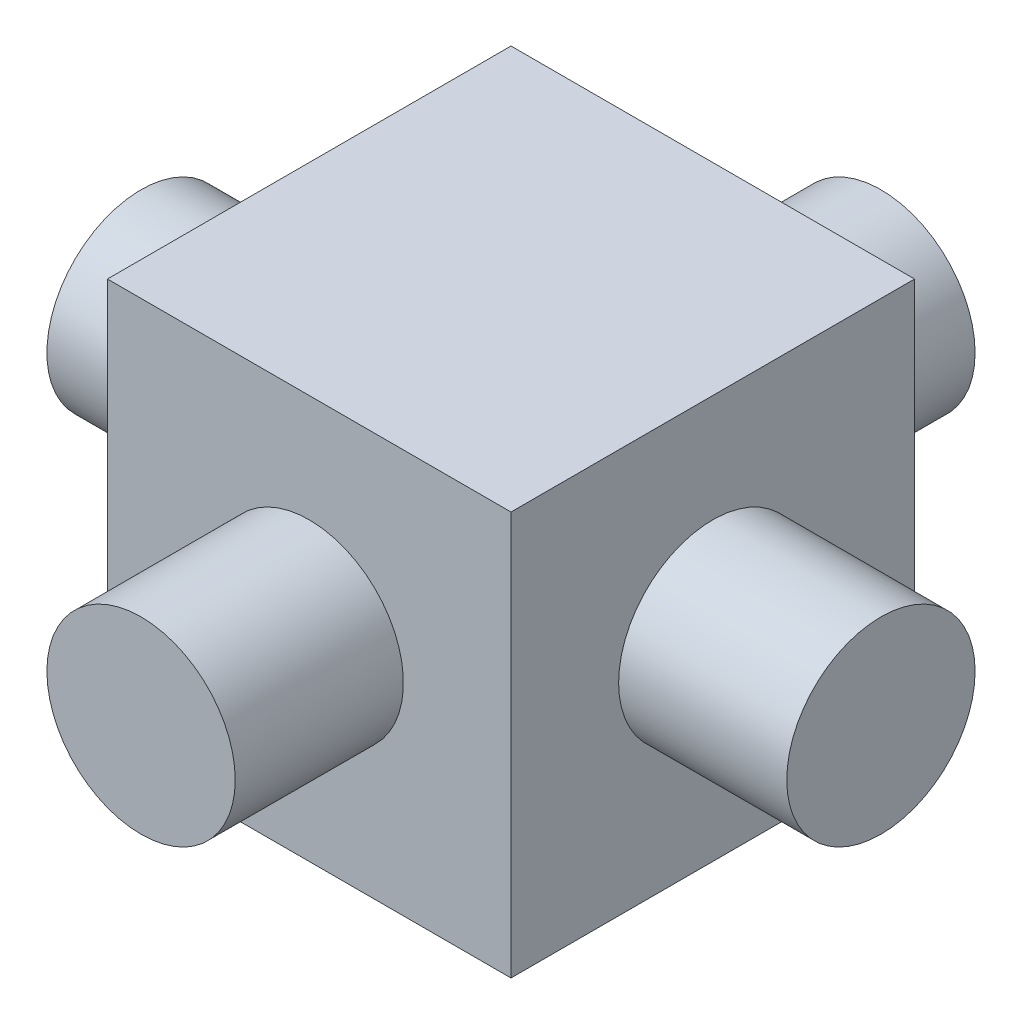
ISO-10303-21;
HEADER;
FILE_DESCRIPTION(('STEP AP214'),'2;1');
FILE_NAME('part.step','',(''),(''),'','','');
FILE_SCHEMA(('AUTOMOTIVE_DESIGN { 1 0 10303 214 1 1 1 1 }'));
ENDSEC;
DATA;
#1=APPLICATION_CONTEXT('core data for automotive mechanical design processes');
#2=APPLICATION_PROTOCOL_DEFINITION('international standard','automotive_design',2000,#1);
#3=PRODUCT_CONTEXT('',#1,'mechanical');
#4=PRODUCT('Part','Part','',(#3));
#5=PRODUCT_RELATED_PRODUCT_CATEGORY('part','',(#4));
#6=PRODUCT_DEFINITION_FORMATION('','',#4);
#7=PRODUCT_DEFINITION_CONTEXT('part definition',#1,'design');
#8=PRODUCT_DEFINITION('design','',#6,#7);
#9=PRODUCT_DEFINITION_SHAPE('','',#8);
#10=(LENGTH_UNIT() NAMED_UNIT(*) SI_UNIT(.MILLI.,.METRE.));
#11=(NAMED_UNIT(*) PLANE_ANGLE_UNIT() SI_UNIT($,.RADIAN.));
#12=(NAMED_UNIT(*) SI_UNIT($,.STERADIAN.) SOLID_ANGLE_UNIT());
#13=UNCERTAINTY_MEASURE_WITH_UNIT(LENGTH_MEASURE(1.E-05),#10,'distance_accuracy_value','');
#14=(GEOMETRIC_REPRESENTATION_CONTEXT(3) GLOBAL_UNCERTAINTY_ASSIGNED_CONTEXT((#13)) GLOBAL_UNIT_ASSIGNED_CONTEXT((#10,
#11,#12)) REPRESENTATION_CONTEXT('',''));
#15=CARTESIAN_POINT('',(0.,0.,0.));
#16=DIRECTION('',(0.,0.,1.));
#17=DIRECTION('',(1.,0.,0.));
#18=AXIS2_PLACEMENT_3D('',#15,#16,#17);
#19=CARTESIAN_POINT('',(3.,6.,-3.));
#20=DIRECTION('',(-1.,0.,0.));
#21=DIRECTION('',(0.,0.,1.));
#22=AXIS2_PLACEMENT_3D('',#19,#20,#21);
#23=PLANE('',#22);
#24=CARTESIAN_POINT('',(3.,3.,0.));
#25=DIRECTION('',(-1.,0.,0.));
#26=DIRECTION('',(0.,0.,1.));
#27=AXIS2_PLACEMENT_3D('',#24,#25,#26);
#28=CIRCLE('',#27,1.4);
#29=CARTESIAN_POINT('',(3.,3.,1.4));
#30=VERTEX_POINT('',#29);
#31=EDGE_CURVE('E11',#30,#30,#28,.F.);
#32=ORIENTED_EDGE('',*,*,#31,.F.);
#33=EDGE_LOOP('',(#32));
#34=FACE_BOUND('',#33,.T.);
#35=DIRECTION('',(0.,0.,-1.));
#36=VECTOR('',#35,1.);
#37=CARTESIAN_POINT('',(3.,0.,-3.));
#38=LINE('',#37,#36);
#39=CARTESIAN_POINT('',(3.,0.,3.));
#40=VERTEX_POINT('',#39);
#41=CARTESIAN_POINT('',(3.,0.,-3.));
#42=VERTEX_POINT('',#41);
#43=EDGE_CURVE('E104',#40,#42,#38,.T.);
#44=ORIENTED_EDGE('',*,*,#43,.T.);
#45=DIRECTION('',(0.,-1.,0.));
#46=VECTOR('',#45,1.);
#47=CARTESIAN_POINT('',(3.,6.,-3.));
#48=LINE('',#47,#46);
#49=CARTESIAN_POINT('',(3.,6.,-3.));
#50=VERTEX_POINT('',#49);
#51=EDGE_CURVE('E95',#50,#42,#48,.T.);
#52=ORIENTED_EDGE('',*,*,#51,.F.);
#53=DIRECTION('',(0.,0.,-1.));
#54=VECTOR('',#53,1.);
#55=CARTESIAN_POINT('',(3.,6.,-3.));
#56=LINE('',#55,#54);
#57=CARTESIAN_POINT('',(3.,6.,3.));
#58=VERTEX_POINT('',#57);
#59=EDGE_CURVE('E89',#58,#50,#56,.T.);
#60=ORIENTED_EDGE('',*,*,#59,.F.);
#61=DIRECTION('',(0.,-1.,0.));
#62=VECTOR('',#61,1.);
#63=CARTESIAN_POINT('',(3.,6.,3.));
#64=LINE('',#63,#62);
#65=EDGE_CURVE('E100',#58,#40,#64,.T.);
#66=ORIENTED_EDGE('',*,*,#65,.T.);
#67=EDGE_LOOP('',(#44,#52,#60,#66));
#68=FACE_BOUND('',#67,.T.);
#69=ADVANCED_FACE('F36',(#34,#68),#23,.F.);
#70=CARTESIAN_POINT('',(-3.,6.,-3.));
#71=DIRECTION('',(0.,0.,1.));
#72=DIRECTION('',(1.,0.,0.));
#73=AXIS2_PLACEMENT_3D('',#70,#71,#72);
#74=PLANE('',#73);
#75=CARTESIAN_POINT('',(0.,3.,-3.));
#76=DIRECTION('',(0.,0.,1.));
#77=DIRECTION('',(1.,0.,0.));
#78=AXIS2_PLACEMENT_3D('',#75,#76,#77);
#79=CIRCLE('',#78,1.4);
#80=CARTESIAN_POINT('',(1.4,3.,-3.));
#81=VERTEX_POINT('',#80);
#82=EDGE_CURVE('E115',#81,#81,#79,.F.);
#83=ORIENTED_EDGE('',*,*,#82,.F.);
#84=EDGE_LOOP('',(#83));
#85=FACE_BOUND('',#84,.T.);
#86=DIRECTION('',(-1.,0.,0.));
#87=VECTOR('',#86,1.);
#88=CARTESIAN_POINT('',(-3.,0.,-3.));
#89=LINE('',#88,#87);
#90=CARTESIAN_POINT('',(-3.,0.,-3.));
#91=VERTEX_POINT('',#90);
#92=EDGE_CURVE('E94',#42,#91,#89,.T.);
#93=ORIENTED_EDGE('',*,*,#92,.T.);
#94=DIRECTION('',(0.,-1.,0.));
#95=VECTOR('',#94,1.);
#96=CARTESIAN_POINT('',(-3.,6.,-3.));
#97=LINE('',#96,#95);
#98=CARTESIAN_POINT('',(-3.,6.,-3.));
#99=VERTEX_POINT('',#98);
#100=EDGE_CURVE('E92',#99,#91,#97,.T.);
#101=ORIENTED_EDGE('',*,*,#100,.F.);
#102=DIRECTION('',(-1.,0.,0.));
#103=VECTOR('',#102,1.);
#104=CARTESIAN_POINT('',(-3.,6.,-3.));
#105=LINE('',#104,#103);
#106=EDGE_CURVE('E84',#50,#99,#105,.T.);
#107=ORIENTED_EDGE('',*,*,#106,.F.);
#108=ORIENTED_EDGE('',*,*,#51,.T.);
#109=EDGE_LOOP('',(#93,#101,#107,#108));
#110=FACE_BOUND('',#109,.T.);
#111=ADVANCED_FACE('F93',(#85,#110),#74,.F.);
#112=CARTESIAN_POINT('',(-3.,6.,-3.));
#113=DIRECTION('',(1.,0.,0.));
#114=DIRECTION('',(0.,0.,-1.));
#115=AXIS2_PLACEMENT_3D('',#112,#113,#114);
#116=PLANE('',#115);
#117=CARTESIAN_POINT('',(-3.,3.,0.));
#118=DIRECTION('',(1.,0.,0.));
#119=DIRECTION('',(0.,0.,-1.));
#120=AXIS2_PLACEMENT_3D('',#117,#118,#119);
#121=CIRCLE('',#120,1.4);
#122=CARTESIAN_POINT('',(-3.,3.,-1.4));
#123=VERTEX_POINT('',#122);
#124=EDGE_CURVE('E39',#123,#123,#121,.F.);
#125=ORIENTED_EDGE('',*,*,#124,.F.);
#126=EDGE_LOOP('',(#125));
#127=FACE_BOUND('',#126,.T.);
#128=DIRECTION('',(0.,0.,1.));
#129=VECTOR('',#128,1.);
#130=CARTESIAN_POINT('',(-3.,0.,-3.));
#131=LINE('',#130,#129);
#132=CARTESIAN_POINT('',(-3.,0.,3.));
#133=VERTEX_POINT('',#132);
#134=EDGE_CURVE('E70',#91,#133,#131,.T.);
#135=ORIENTED_EDGE('',*,*,#134,.T.);
#136=DIRECTION('',(0.,-1.,0.));
#137=VECTOR('',#136,1.);
#138=CARTESIAN_POINT('',(-3.,6.,3.));
#139=LINE('',#138,#137);
#140=CARTESIAN_POINT('',(-3.,6.,3.));
#141=VERTEX_POINT('',#140);
#142=EDGE_CURVE('E96',#141,#133,#139,.T.);
#143=ORIENTED_EDGE('',*,*,#142,.F.);
#144=DIRECTION('',(0.,0.,1.));
#145=VECTOR('',#144,1.);
#146=CARTESIAN_POINT('',(-3.,6.,-3.));
#147=LINE('',#146,#145);
#148=EDGE_CURVE('E87',#99,#141,#147,.T.);
#149=ORIENTED_EDGE('',*,*,#148,.F.);
#150=ORIENTED_EDGE('',*,*,#100,.T.);
#151=EDGE_LOOP('',(#135,#143,#149,#150));
#152=FACE_BOUND('',#151,.T.);
#153=ADVANCED_FACE('F98',(#127,#152),#116,.F.);
#154=CARTESIAN_POINT('',(-3.,6.,3.));
#155=DIRECTION('',(0.,0.,-1.));
#156=DIRECTION('',(-1.,0.,0.));
#157=AXIS2_PLACEMENT_3D('',#154,#155,#156);
#158=PLANE('',#157);
#159=CARTESIAN_POINT('',(0.,3.,3.));
#160=DIRECTION('',(0.,0.,-1.));
#161=DIRECTION('',(-1.,0.,0.));
#162=AXIS2_PLACEMENT_3D('',#159,#160,#161);
#163=CIRCLE('',#162,1.4);
#164=CARTESIAN_POINT('',(-1.4,3.,3.));
#165=VERTEX_POINT('',#164);
#166=EDGE_CURVE('E113',#165,#165,#163,.F.);
#167=ORIENTED_EDGE('',*,*,#166,.F.);
#168=EDGE_LOOP('',(#167));
#169=FACE_BOUND('',#168,.T.);
#170=DIRECTION('',(1.,0.,0.));
#171=VECTOR('',#170,1.);
#172=CARTESIAN_POINT('',(-3.,0.,3.));
#173=LINE('',#172,#171);
#174=EDGE_CURVE('E76',#133,#40,#173,.T.);
#175=ORIENTED_EDGE('',*,*,#174,.T.);
#176=ORIENTED_EDGE('',*,*,#65,.F.);
#177=DIRECTION('',(1.,0.,0.));
#178=VECTOR('',#177,1.);
#179=CARTESIAN_POINT('',(-3.,6.,3.));
#180=LINE('',#179,#178);
#181=EDGE_CURVE('E53',#141,#58,#180,.T.);
#182=ORIENTED_EDGE('',*,*,#181,.F.);
#183=ORIENTED_EDGE('',*,*,#142,.T.);
#184=EDGE_LOOP('',(#175,#176,#182,#183));
#185=FACE_BOUND('',#184,.T.);
#186=ADVANCED_FACE('F160',(#169,#185),#158,.F.);
#187=CARTESIAN_POINT('',(0.,6.,0.));
#188=DIRECTION('',(0.,1.,0.));
#189=DIRECTION('',(0.,0.,1.));
#190=AXIS2_PLACEMENT_3D('',#187,#188,#189);
#191=PLANE('',#190);
#192=ORIENTED_EDGE('',*,*,#59,.T.);
#193=ORIENTED_EDGE('',*,*,#106,.T.);
#194=ORIENTED_EDGE('',*,*,#148,.T.);
#195=ORIENTED_EDGE('',*,*,#181,.T.);
#196=EDGE_LOOP('',(#192,#193,#194,#195));
#197=FACE_BOUND('',#196,.T.);
#198=ADVANCED_FACE('F85',(#197),#191,.T.);
#199=CARTESIAN_POINT('',(0.,0.,0.));
#200=DIRECTION('',(0.,1.,0.));
#201=DIRECTION('',(0.,0.,1.));
#202=AXIS2_PLACEMENT_3D('',#199,#200,#201);
#203=PLANE('',#202);
#204=ORIENTED_EDGE('',*,*,#43,.F.);
#205=ORIENTED_EDGE('',*,*,#174,.F.);
#206=ORIENTED_EDGE('',*,*,#134,.F.);
#207=ORIENTED_EDGE('',*,*,#92,.F.);
#208=EDGE_LOOP('',(#204,#205,#206,#207));
#209=FACE_BOUND('',#208,.T.);
#210=ADVANCED_FACE('F149',(#209),#203,.F.);
#211=CARTESIAN_POINT('',(0.,3.,5.5));
#212=DIRECTION('',(0.,0.,1.));
#213=DIRECTION('',(1.,0.,0.));
#214=AXIS2_PLACEMENT_3D('',#211,#212,#213);
#215=PLANE('',#214);
#216=CARTESIAN_POINT('',(0.,3.,5.5));
#217=DIRECTION('',(0.,0.,1.));
#218=DIRECTION('',(1.,0.,0.));
#219=AXIS2_PLACEMENT_3D('',#216,#217,#218);
#220=CIRCLE('',#219,1.4);
#221=CARTESIAN_POINT('',(1.4,3.,5.5));
#222=VERTEX_POINT('',#221);
#223=EDGE_CURVE('E107',#222,#222,#220,.T.);
#224=ORIENTED_EDGE('',*,*,#223,.T.);
#225=EDGE_LOOP('',(#224));
#226=FACE_BOUND('',#225,.T.);
#227=ADVANCED_FACE('F151',(#226),#215,.T.);
#228=CARTESIAN_POINT('',(0.,3.,5.5));
#229=DIRECTION('',(0.,0.,-1.));
#230=DIRECTION('',(-1.,0.,0.));
#231=AXIS2_PLACEMENT_3D('',#228,#229,#230);
#232=CYLINDRICAL_SURFACE('',#231,1.4);
#233=ORIENTED_EDGE('',*,*,#223,.F.);
#234=EDGE_LOOP('',(#233));
#235=FACE_BOUND('',#234,.T.);
#236=ORIENTED_EDGE('',*,*,#166,.T.);
#237=EDGE_LOOP('',(#236));
#238=FACE_BOUND('',#237,.T.);
#239=ADVANCED_FACE('F157',(#235,#238),#232,.T.);
#240=CARTESIAN_POINT('',(0.,3.,-5.5));
#241=DIRECTION('',(0.,0.,1.));
#242=DIRECTION('',(1.,0.,0.));
#243=AXIS2_PLACEMENT_3D('',#240,#241,#242);
#244=CIRCLE('',#243,1.4);
#245=CARTESIAN_POINT('',(1.4,3.,-5.5));
#246=VERTEX_POINT('',#245);
#247=EDGE_CURVE('E124',#246,#246,#244,.T.);
#248=ORIENTED_EDGE('',*,*,#247,.T.);
#249=EDGE_LOOP('',(#248));
#250=FACE_BOUND('',#249,.T.);
#251=ORIENTED_EDGE('',*,*,#82,.T.);
#252=EDGE_LOOP('',(#251));
#253=FACE_BOUND('',#252,.T.);
#254=ADVANCED_FACE('F207',(#250,#253),#232,.T.);
#255=CARTESIAN_POINT('',(0.,3.,-5.5));
#256=DIRECTION('',(0.,0.,1.));
#257=DIRECTION('',(1.,0.,0.));
#258=AXIS2_PLACEMENT_3D('',#255,#256,#257);
#259=PLANE('',#258);
#260=ORIENTED_EDGE('',*,*,#247,.F.);
#261=EDGE_LOOP('',(#260));
#262=FACE_BOUND('',#261,.T.);
#263=ADVANCED_FACE('F215',(#262),#259,.F.);
#264=CARTESIAN_POINT('',(-5.5,3.,0.));
#265=DIRECTION('',(1.,0.,0.));
#266=DIRECTION('',(0.,0.,-1.));
#267=AXIS2_PLACEMENT_3D('',#264,#265,#266);
#268=PLANE('',#267);
#269=CARTESIAN_POINT('',(-5.5,3.,0.));
#270=DIRECTION('',(1.,0.,0.));
#271=DIRECTION('',(0.,0.,-1.));
#272=AXIS2_PLACEMENT_3D('',#269,#270,#271);
#273=CIRCLE('',#272,1.4);
#274=CARTESIAN_POINT('',(-5.5,3.,-1.4));
#275=VERTEX_POINT('',#274);
#276=EDGE_CURVE('E130',#275,#275,#273,.T.);
#277=ORIENTED_EDGE('',*,*,#276,.F.);
#278=EDGE_LOOP('',(#277));
#279=FACE_BOUND('',#278,.T.);
#280=ADVANCED_FACE('F223',(#279),#268,.F.);
#281=CARTESIAN_POINT('',(5.5,3.,0.));
#282=DIRECTION('',(-1.,0.,0.));
#283=DIRECTION('',(0.,0.,1.));
#284=AXIS2_PLACEMENT_3D('',#281,#282,#283);
#285=CYLINDRICAL_SURFACE('',#284,1.4);
#286=ORIENTED_EDGE('',*,*,#276,.T.);
#287=EDGE_LOOP('',(#286));
#288=FACE_BOUND('',#287,.T.);
#289=ORIENTED_EDGE('',*,*,#124,.T.);
#290=EDGE_LOOP('',(#289));
#291=FACE_BOUND('',#290,.T.);
#292=ADVANCED_FACE('F141',(#288,#291),#285,.T.);
#293=CARTESIAN_POINT('',(5.5,3.,0.));
#294=DIRECTION('',(1.,0.,0.));
#295=DIRECTION('',(0.,0.,-1.));
#296=AXIS2_PLACEMENT_3D('',#293,#294,#295);
#297=CIRCLE('',#296,1.4);
#298=CARTESIAN_POINT('',(5.5,3.,-1.4));
#299=VERTEX_POINT('',#298);
#300=EDGE_CURVE('E127',#299,#299,#297,.T.);
#301=ORIENTED_EDGE('',*,*,#300,.F.);
#302=EDGE_LOOP('',(#301));
#303=FACE_BOUND('',#302,.T.);
#304=ORIENTED_EDGE('',*,*,#31,.T.);
#305=EDGE_LOOP('',(#304));
#306=FACE_BOUND('',#305,.T.);
#307=ADVANCED_FACE('F138',(#303,#306),#285,.T.);
#308=CARTESIAN_POINT('',(5.5,3.,0.));
#309=DIRECTION('',(1.,0.,0.));
#310=DIRECTION('',(0.,0.,-1.));
#311=AXIS2_PLACEMENT_3D('',#308,#309,#310);
#312=PLANE('',#311);
#313=ORIENTED_EDGE('',*,*,#300,.T.);
#314=EDGE_LOOP('',(#313));
#315=FACE_BOUND('',#314,.T.);
#316=ADVANCED_FACE('F136',(#315),#312,.T.);
#317=CLOSED_SHELL('',(#69,#111,#153,#186,#198,#210,#227,#239,#254,#263,#280,#292,#307,#316));
#318=MANIFOLD_SOLID_BREP('B2',#317);
#319=ADVANCED_BREP_SHAPE_REPRESENTATION('',(#18,#318),#14);
#320=SHAPE_DEFINITION_REPRESENTATION(#9,#319);
ENDSEC;
END-ISO-10303-21;
